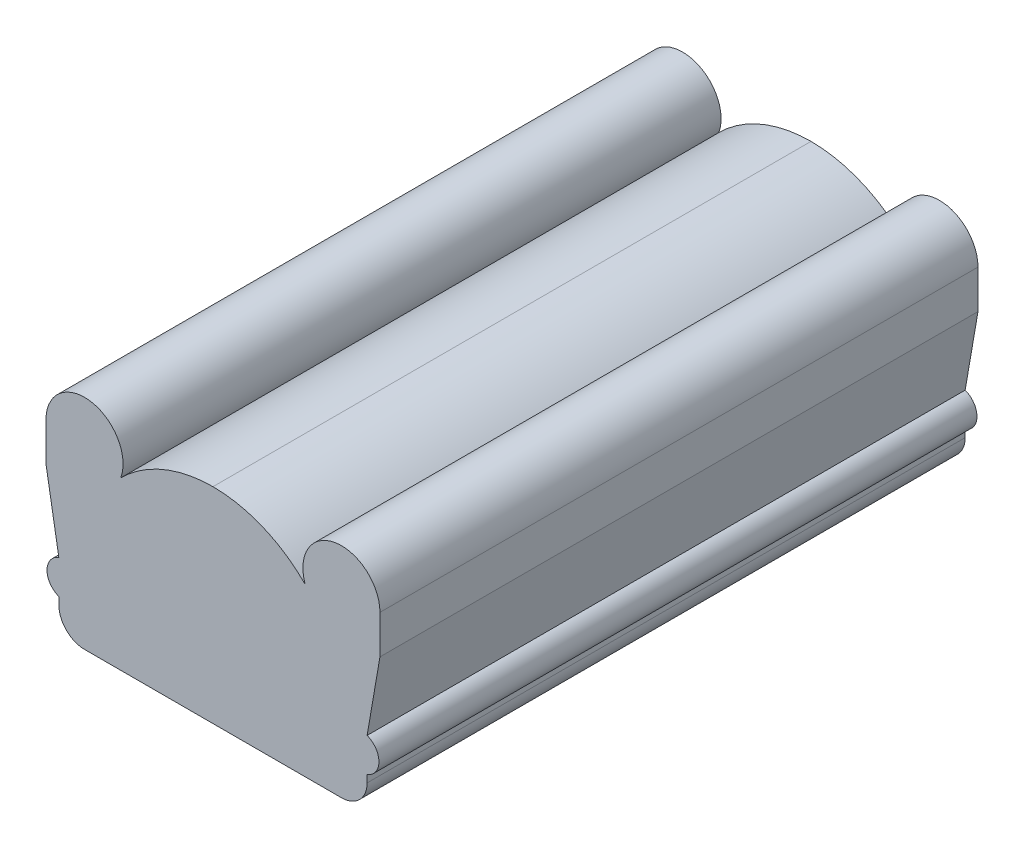
ISO-10303-21;
HEADER;
FILE_DESCRIPTION(('STEP AP214'),'2;1');
FILE_NAME('part.step','',(''),(''),'','','');
FILE_SCHEMA(('AUTOMOTIVE_DESIGN { 1 0 10303 214 1 1 1 1 }'));
ENDSEC;
DATA;
#1=APPLICATION_CONTEXT('core data for automotive mechanical design processes');
#2=APPLICATION_PROTOCOL_DEFINITION('international standard','automotive_design',2000,#1);
#3=PRODUCT_CONTEXT('',#1,'mechanical');
#4=PRODUCT('Part','Part','',(#3));
#5=PRODUCT_RELATED_PRODUCT_CATEGORY('part','',(#4));
#6=PRODUCT_DEFINITION_FORMATION('','',#4);
#7=PRODUCT_DEFINITION_CONTEXT('part definition',#1,'design');
#8=PRODUCT_DEFINITION('design','',#6,#7);
#9=PRODUCT_DEFINITION_SHAPE('','',#8);
#10=(LENGTH_UNIT() NAMED_UNIT(*) SI_UNIT(.MILLI.,.METRE.));
#11=(NAMED_UNIT(*) PLANE_ANGLE_UNIT() SI_UNIT($,.RADIAN.));
#12=(NAMED_UNIT(*) SI_UNIT($,.STERADIAN.) SOLID_ANGLE_UNIT());
#13=UNCERTAINTY_MEASURE_WITH_UNIT(LENGTH_MEASURE(1.E-05),#10,'distance_accuracy_value','');
#14=(GEOMETRIC_REPRESENTATION_CONTEXT(3) GLOBAL_UNCERTAINTY_ASSIGNED_CONTEXT((#13)) GLOBAL_UNIT_ASSIGNED_CONTEXT((#10,
#11,#12)) REPRESENTATION_CONTEXT('',''));
#15=CARTESIAN_POINT('',(0.,0.,0.));
#16=DIRECTION('',(0.,0.,1.));
#17=DIRECTION('',(1.,0.,0.));
#18=AXIS2_PLACEMENT_3D('',#15,#16,#17);
#19=CARTESIAN_POINT('',(-0.161961658351417,36.9481996765618,295.656));
#20=DIRECTION('',(0.,0.,-1.));
#21=DIRECTION('',(-1.,0.,0.));
#22=AXIS2_PLACEMENT_3D('',#19,#20,#21);
#23=CYLINDRICAL_SURFACE('',#22,64.4865199814833);
#24=CARTESIAN_POINT('',(-0.161961658351417,36.9481996765618,0.));
#25=DIRECTION('',(0.,0.,1.));
#26=DIRECTION('',(1.,0.,0.));
#27=AXIS2_PLACEMENT_3D('',#24,#25,#26);
#28=CIRCLE('',#27,64.4865199814833);
#29=CARTESIAN_POINT('',(45.5988555740285,82.3845162696459,0.));
#30=VERTEX_POINT('',#29);
#31=CARTESIAN_POINT('',(0.,101.434516269646,0.));
#32=VERTEX_POINT('',#31);
#33=EDGE_CURVE('E165',#30,#32,#28,.T.);
#34=ORIENTED_EDGE('',*,*,#33,.T.);
#35=DIRECTION('',(0.,0.,-1.));
#36=VECTOR('',#35,1.);
#37=CARTESIAN_POINT('',(0.,101.434516269646,295.656));
#38=LINE('',#37,#36);
#39=CARTESIAN_POINT('',(0.,101.434516269646,295.656));
#40=VERTEX_POINT('',#39);
#41=EDGE_CURVE('E147',#40,#32,#38,.T.);
#42=ORIENTED_EDGE('',*,*,#41,.F.);
#43=CARTESIAN_POINT('',(-0.161961658351417,36.9481996765618,295.656));
#44=DIRECTION('',(0.,0.,1.));
#45=DIRECTION('',(1.,0.,0.));
#46=AXIS2_PLACEMENT_3D('',#43,#44,#45);
#47=CIRCLE('',#46,64.4865199814833);
#48=CARTESIAN_POINT('',(45.5988555740285,82.3845162696459,295.656));
#49=VERTEX_POINT('',#48);
#50=EDGE_CURVE('E153',#49,#40,#47,.T.);
#51=ORIENTED_EDGE('',*,*,#50,.F.);
#52=DIRECTION('',(0.,0.,-1.));
#53=VECTOR('',#52,1.);
#54=CARTESIAN_POINT('',(45.5988555740285,82.3845162696459,295.656));
#55=LINE('',#54,#53);
#56=EDGE_CURVE('E221',#49,#30,#55,.T.);
#57=ORIENTED_EDGE('',*,*,#56,.T.);
#58=EDGE_LOOP('',(#34,#42,#51,#57));
#59=FACE_BOUND('',#58,.T.);
#60=ADVANCED_FACE('F33',(#59),#23,.T.);
#61=CARTESIAN_POINT('',(0.161961658351417,36.9481996765618,295.656));
#62=DIRECTION('',(0.,0.,-1.));
#63=DIRECTION('',(-1.,0.,0.));
#64=AXIS2_PLACEMENT_3D('',#61,#62,#63);
#65=CYLINDRICAL_SURFACE('',#64,64.4865199814833);
#66=CARTESIAN_POINT('',(0.161961658351417,36.9481996765618,0.));
#67=DIRECTION('',(0.,0.,1.));
#68=DIRECTION('',(-1.,0.,0.));
#69=AXIS2_PLACEMENT_3D('',#66,#67,#68);
#70=CIRCLE('',#69,64.4865199814833);
#71=CARTESIAN_POINT('',(-45.5988555740285,82.3845162696458,0.));
#72=VERTEX_POINT('',#71);
#73=EDGE_CURVE('E255',#32,#72,#70,.T.);
#74=ORIENTED_EDGE('',*,*,#73,.T.);
#75=DIRECTION('',(0.,0.,-1.));
#76=VECTOR('',#75,1.);
#77=CARTESIAN_POINT('',(-45.5988555740285,82.3845162696458,295.656));
#78=LINE('',#77,#76);
#79=CARTESIAN_POINT('',(-45.5988555740285,82.3845162696458,295.656));
#80=VERTEX_POINT('',#79);
#81=EDGE_CURVE('E150',#80,#72,#78,.T.);
#82=ORIENTED_EDGE('',*,*,#81,.F.);
#83=CARTESIAN_POINT('',(0.161961658351417,36.9481996765618,295.656));
#84=DIRECTION('',(0.,0.,1.));
#85=DIRECTION('',(-1.,0.,0.));
#86=AXIS2_PLACEMENT_3D('',#83,#84,#85);
#87=CIRCLE('',#86,64.4865199814833);
#88=EDGE_CURVE('E143',#40,#80,#87,.T.);
#89=ORIENTED_EDGE('',*,*,#88,.F.);
#90=ORIENTED_EDGE('',*,*,#41,.T.);
#91=EDGE_LOOP('',(#74,#82,#89,#90));
#92=FACE_BOUND('',#91,.T.);
#93=ADVANCED_FACE('F145',(#92),#65,.T.);
#94=CARTESIAN_POINT('',(-63.5,88.9,295.656));
#95=DIRECTION('',(0.,0.,-1.));
#96=DIRECTION('',(-1.,0.,0.));
#97=AXIS2_PLACEMENT_3D('',#94,#95,#96);
#98=CYLINDRICAL_SURFACE('',#97,19.05);
#99=CARTESIAN_POINT('',(-63.5,88.9,0.));
#100=DIRECTION('',(0.,0.,1.));
#101=DIRECTION('',(1.,0.,0.));
#102=AXIS2_PLACEMENT_3D('',#99,#100,#101);
#103=CIRCLE('',#102,19.05);
#104=CARTESIAN_POINT('',(-82.55,88.9,0.));
#105=VERTEX_POINT('',#104);
#106=EDGE_CURVE('E253',#72,#105,#103,.T.);
#107=ORIENTED_EDGE('',*,*,#106,.T.);
#108=DIRECTION('',(0.,0.,-1.));
#109=VECTOR('',#108,1.);
#110=CARTESIAN_POINT('',(-82.55,88.9,295.656));
#111=LINE('',#110,#109);
#112=CARTESIAN_POINT('',(-82.55,88.9,295.656));
#113=VERTEX_POINT('',#112);
#114=EDGE_CURVE('E170',#113,#105,#111,.T.);
#115=ORIENTED_EDGE('',*,*,#114,.F.);
#116=CARTESIAN_POINT('',(-63.5,88.9,295.656));
#117=DIRECTION('',(0.,0.,1.));
#118=DIRECTION('',(1.,0.,0.));
#119=AXIS2_PLACEMENT_3D('',#116,#117,#118);
#120=CIRCLE('',#119,19.05);
#121=EDGE_CURVE('E152',#80,#113,#120,.T.);
#122=ORIENTED_EDGE('',*,*,#121,.F.);
#123=ORIENTED_EDGE('',*,*,#81,.T.);
#124=EDGE_LOOP('',(#107,#115,#122,#123));
#125=FACE_BOUND('',#124,.T.);
#126=ADVANCED_FACE('F274',(#125),#98,.T.);
#127=CARTESIAN_POINT('',(-82.55,88.9,295.656));
#128=DIRECTION('',(1.,0.,0.));
#129=DIRECTION('',(0.,0.,-1.));
#130=AXIS2_PLACEMENT_3D('',#127,#128,#129);
#131=PLANE('',#130);
#132=DIRECTION('',(0.,-1.,0.));
#133=VECTOR('',#132,1.);
#134=CARTESIAN_POINT('',(-82.55,88.9,0.));
#135=LINE('',#134,#133);
#136=CARTESIAN_POINT('',(-82.55,69.85,0.));
#137=VERTEX_POINT('',#136);
#138=EDGE_CURVE('E248',#105,#137,#135,.T.);
#139=ORIENTED_EDGE('',*,*,#138,.T.);
#140=DIRECTION('',(0.,0.,-1.));
#141=VECTOR('',#140,1.);
#142=CARTESIAN_POINT('',(-82.55,69.85,295.656));
#143=LINE('',#142,#141);
#144=CARTESIAN_POINT('',(-82.55,69.85,295.656));
#145=VERTEX_POINT('',#144);
#146=EDGE_CURVE('E239',#145,#137,#143,.T.);
#147=ORIENTED_EDGE('',*,*,#146,.F.);
#148=DIRECTION('',(0.,-1.,0.));
#149=VECTOR('',#148,1.);
#150=CARTESIAN_POINT('',(-82.55,88.9,295.656));
#151=LINE('',#150,#149);
#152=EDGE_CURVE('E249',#113,#145,#151,.T.);
#153=ORIENTED_EDGE('',*,*,#152,.F.);
#154=ORIENTED_EDGE('',*,*,#114,.T.);
#155=EDGE_LOOP('',(#139,#147,#153,#154));
#156=FACE_BOUND('',#155,.T.);
#157=ADVANCED_FACE('F246',(#156),#131,.F.);
#158=CARTESIAN_POINT('',(-82.55,69.85,295.656));
#159=DIRECTION('',(0.985460115744348,0.169906916507646,0.));
#160=DIRECTION('',(-0.169906916507646,0.985460115744348,0.));
#161=AXIS2_PLACEMENT_3D('',#158,#159,#160);
#162=PLANE('',#161);
#163=DIRECTION('',(0.169906916507646,-0.985460115744348,0.));
#164=VECTOR('',#163,1.);
#165=CARTESIAN_POINT('',(-82.55,69.85,0.));
#166=LINE('',#165,#164);
#167=CARTESIAN_POINT('',(-76.2,33.02,0.));
#168=VERTEX_POINT('',#167);
#169=EDGE_CURVE('E209',#137,#168,#166,.T.);
#170=ORIENTED_EDGE('',*,*,#169,.T.);
#171=DIRECTION('',(0.,0.,-1.));
#172=VECTOR('',#171,1.);
#173=CARTESIAN_POINT('',(-76.2,33.02,295.656));
#174=LINE('',#173,#172);
#175=CARTESIAN_POINT('',(-76.2,33.02,295.656));
#176=VERTEX_POINT('',#175);
#177=EDGE_CURVE('E236',#176,#168,#174,.T.);
#178=ORIENTED_EDGE('',*,*,#177,.F.);
#179=DIRECTION('',(0.169906916507646,-0.985460115744348,0.));
#180=VECTOR('',#179,1.);
#181=CARTESIAN_POINT('',(-82.55,69.85,295.656));
#182=LINE('',#181,#180);
#183=EDGE_CURVE('E271',#145,#176,#182,.T.);
#184=ORIENTED_EDGE('',*,*,#183,.F.);
#185=ORIENTED_EDGE('',*,*,#146,.T.);
#186=EDGE_LOOP('',(#170,#178,#184,#185));
#187=FACE_BOUND('',#186,.T.);
#188=ADVANCED_FACE('F281',(#187),#162,.F.);
#189=CARTESIAN_POINT('',(-73.152,24.668844630831,295.656));
#190=DIRECTION('',(0.,0.,-1.));
#191=DIRECTION('',(-1.,0.,0.));
#192=AXIS2_PLACEMENT_3D('',#189,#190,#191);
#193=CYLINDRICAL_SURFACE('',#192,8.89);
#194=CARTESIAN_POINT('',(-73.152,24.668844630831,0.));
#195=DIRECTION('',(0.,0.,1.));
#196=DIRECTION('',(1.,0.,0.));
#197=AXIS2_PLACEMENT_3D('',#194,#195,#196);
#198=CIRCLE('',#197,8.89);
#199=CARTESIAN_POINT('',(-76.2,16.317689261662,0.));
#200=VERTEX_POINT('',#199);
#201=EDGE_CURVE('E205',#168,#200,#198,.T.);
#202=ORIENTED_EDGE('',*,*,#201,.T.);
#203=DIRECTION('',(0.,0.,-1.));
#204=VECTOR('',#203,1.);
#205=CARTESIAN_POINT('',(-76.2,16.317689261662,295.656));
#206=LINE('',#205,#204);
#207=CARTESIAN_POINT('',(-76.2,16.317689261662,295.656));
#208=VERTEX_POINT('',#207);
#209=EDGE_CURVE('E204',#208,#200,#206,.T.);
#210=ORIENTED_EDGE('',*,*,#209,.F.);
#211=CARTESIAN_POINT('',(-73.152,24.668844630831,295.656));
#212=DIRECTION('',(0.,0.,1.));
#213=DIRECTION('',(1.,0.,0.));
#214=AXIS2_PLACEMENT_3D('',#211,#212,#213);
#215=CIRCLE('',#214,8.89);
#216=EDGE_CURVE('E269',#176,#208,#215,.T.);
#217=ORIENTED_EDGE('',*,*,#216,.F.);
#218=ORIENTED_EDGE('',*,*,#177,.T.);
#219=EDGE_LOOP('',(#202,#210,#217,#218));
#220=FACE_BOUND('',#219,.T.);
#221=ADVANCED_FACE('F324',(#220),#193,.T.);
#222=CARTESIAN_POINT('',(-76.2,16.317689261662,295.656));
#223=DIRECTION('',(1.,0.,0.));
#224=DIRECTION('',(0.,0.,-1.));
#225=AXIS2_PLACEMENT_3D('',#222,#223,#224);
#226=PLANE('',#225);
#227=DIRECTION('',(0.,-1.,0.));
#228=VECTOR('',#227,1.);
#229=CARTESIAN_POINT('',(-76.2,16.317689261662,0.));
#230=LINE('',#229,#228);
#231=CARTESIAN_POINT('',(-76.2,12.7,0.));
#232=VERTEX_POINT('',#231);
#233=EDGE_CURVE('E199',#200,#232,#230,.T.);
#234=ORIENTED_EDGE('',*,*,#233,.T.);
#235=DIRECTION('',(0.,0.,-1.));
#236=VECTOR('',#235,1.);
#237=CARTESIAN_POINT('',(-76.2,12.7,295.656));
#238=LINE('',#237,#236);
#239=CARTESIAN_POINT('',(-76.2,12.7,295.656));
#240=VERTEX_POINT('',#239);
#241=EDGE_CURVE('E56',#232,#240,#238,.F.);
#242=ORIENTED_EDGE('',*,*,#241,.T.);
#243=DIRECTION('',(0.,-1.,0.));
#244=VECTOR('',#243,1.);
#245=CARTESIAN_POINT('',(-76.2,16.317689261662,295.656));
#246=LINE('',#245,#244);
#247=EDGE_CURVE('E184',#208,#240,#246,.T.);
#248=ORIENTED_EDGE('',*,*,#247,.F.);
#249=ORIENTED_EDGE('',*,*,#209,.T.);
#250=EDGE_LOOP('',(#234,#242,#248,#249));
#251=FACE_BOUND('',#250,.T.);
#252=ADVANCED_FACE('F202',(#251),#226,.F.);
#253=CARTESIAN_POINT('',(76.2,0.,295.656));
#254=DIRECTION('',(0.,1.,0.));
#255=DIRECTION('',(0.,0.,1.));
#256=AXIS2_PLACEMENT_3D('',#253,#254,#255);
#257=PLANE('',#256);
#258=DIRECTION('',(1.,0.,0.));
#259=VECTOR('',#258,1.);
#260=CARTESIAN_POINT('',(76.2,0.,295.656));
#261=LINE('',#260,#259);
#262=CARTESIAN_POINT('',(-63.4999999999999,0.,295.656));
#263=VERTEX_POINT('',#262);
#264=CARTESIAN_POINT('',(63.5,0.,295.656));
#265=VERTEX_POINT('',#264);
#266=EDGE_CURVE('E183',#263,#265,#261,.T.);
#267=ORIENTED_EDGE('',*,*,#266,.F.);
#268=DIRECTION('',(0.,0.,-1.));
#269=VECTOR('',#268,1.);
#270=CARTESIAN_POINT('',(-63.5,0.,295.656));
#271=LINE('',#270,#269);
#272=CARTESIAN_POINT('',(-63.4999999999999,0.,0.));
#273=VERTEX_POINT('',#272);
#274=EDGE_CURVE('E168',#263,#273,#271,.T.);
#275=ORIENTED_EDGE('',*,*,#274,.T.);
#276=DIRECTION('',(1.,0.,0.));
#277=VECTOR('',#276,1.);
#278=CARTESIAN_POINT('',(76.2,0.,0.));
#279=LINE('',#278,#277);
#280=CARTESIAN_POINT('',(63.5,0.,0.));
#281=VERTEX_POINT('',#280);
#282=EDGE_CURVE('E200',#273,#281,#279,.T.);
#283=ORIENTED_EDGE('',*,*,#282,.T.);
#284=DIRECTION('',(0.,0.,-1.));
#285=VECTOR('',#284,1.);
#286=CARTESIAN_POINT('',(63.5,0.,295.656));
#287=LINE('',#286,#285);
#288=EDGE_CURVE('E166',#281,#265,#287,.F.);
#289=ORIENTED_EDGE('',*,*,#288,.T.);
#290=EDGE_LOOP('',(#267,#275,#283,#289));
#291=FACE_BOUND('',#290,.T.);
#292=ADVANCED_FACE('F188',(#291),#257,.F.);
#293=CARTESIAN_POINT('',(76.2,16.317689261662,295.656));
#294=DIRECTION('',(-1.,0.,0.));
#295=DIRECTION('',(0.,0.,1.));
#296=AXIS2_PLACEMENT_3D('',#293,#294,#295);
#297=PLANE('',#296);
#298=DIRECTION('',(0.,1.,0.));
#299=VECTOR('',#298,1.);
#300=CARTESIAN_POINT('',(76.2,16.317689261662,295.656));
#301=LINE('',#300,#299);
#302=CARTESIAN_POINT('',(76.2,12.7,295.656));
#303=VERTEX_POINT('',#302);
#304=CARTESIAN_POINT('',(76.2,16.317689261662,295.656));
#305=VERTEX_POINT('',#304);
#306=EDGE_CURVE('E192',#303,#305,#301,.T.);
#307=ORIENTED_EDGE('',*,*,#306,.F.);
#308=DIRECTION('',(0.,0.,-1.));
#309=VECTOR('',#308,1.);
#310=CARTESIAN_POINT('',(76.2,12.7,295.656));
#311=LINE('',#310,#309);
#312=CARTESIAN_POINT('',(76.2,12.7,0.));
#313=VERTEX_POINT('',#312);
#314=EDGE_CURVE('E11',#303,#313,#311,.T.);
#315=ORIENTED_EDGE('',*,*,#314,.T.);
#316=DIRECTION('',(0.,1.,0.));
#317=VECTOR('',#316,1.);
#318=CARTESIAN_POINT('',(76.2,16.317689261662,0.));
#319=LINE('',#318,#317);
#320=CARTESIAN_POINT('',(76.2,16.317689261662,0.));
#321=VERTEX_POINT('',#320);
#322=EDGE_CURVE('E207',#313,#321,#319,.T.);
#323=ORIENTED_EDGE('',*,*,#322,.T.);
#324=DIRECTION('',(0.,0.,-1.));
#325=VECTOR('',#324,1.);
#326=CARTESIAN_POINT('',(76.2,16.317689261662,295.656));
#327=LINE('',#326,#325);
#328=EDGE_CURVE('E232',#305,#321,#327,.T.);
#329=ORIENTED_EDGE('',*,*,#328,.F.);
#330=EDGE_LOOP('',(#307,#315,#323,#329));
#331=FACE_BOUND('',#330,.T.);
#332=ADVANCED_FACE('F315',(#331),#297,.F.);
#333=CARTESIAN_POINT('',(73.152,24.668844630831,295.656));
#334=DIRECTION('',(0.,0.,-1.));
#335=DIRECTION('',(-1.,0.,0.));
#336=AXIS2_PLACEMENT_3D('',#333,#334,#335);
#337=CYLINDRICAL_SURFACE('',#336,8.89);
#338=CARTESIAN_POINT('',(73.152,24.668844630831,0.));
#339=DIRECTION('',(0.,0.,1.));
#340=DIRECTION('',(-1.,0.,0.));
#341=AXIS2_PLACEMENT_3D('',#338,#339,#340);
#342=CIRCLE('',#341,8.89);
#343=CARTESIAN_POINT('',(76.2,33.02,0.));
#344=VERTEX_POINT('',#343);
#345=EDGE_CURVE('E214',#321,#344,#342,.T.);
#346=ORIENTED_EDGE('',*,*,#345,.T.);
#347=DIRECTION('',(0.,0.,-1.));
#348=VECTOR('',#347,1.);
#349=CARTESIAN_POINT('',(76.2,33.02,295.656));
#350=LINE('',#349,#348);
#351=CARTESIAN_POINT('',(76.2,33.02,295.656));
#352=VERTEX_POINT('',#351);
#353=EDGE_CURVE('E229',#352,#344,#350,.T.);
#354=ORIENTED_EDGE('',*,*,#353,.F.);
#355=CARTESIAN_POINT('',(73.152,24.668844630831,295.656));
#356=DIRECTION('',(0.,0.,1.));
#357=DIRECTION('',(-1.,0.,0.));
#358=AXIS2_PLACEMENT_3D('',#355,#356,#357);
#359=CIRCLE('',#358,8.89);
#360=EDGE_CURVE('E265',#305,#352,#359,.T.);
#361=ORIENTED_EDGE('',*,*,#360,.F.);
#362=ORIENTED_EDGE('',*,*,#328,.T.);
#363=EDGE_LOOP('',(#346,#354,#361,#362));
#364=FACE_BOUND('',#363,.T.);
#365=ADVANCED_FACE('F311',(#364),#337,.T.);
#366=CARTESIAN_POINT('',(82.55,69.85,295.656));
#367=DIRECTION('',(-0.985460115744348,0.169906916507646,0.));
#368=DIRECTION('',(-0.169906916507646,-0.985460115744348,0.));
#369=AXIS2_PLACEMENT_3D('',#366,#367,#368);
#370=PLANE('',#369);
#371=DIRECTION('',(0.169906916507646,0.985460115744348,0.));
#372=VECTOR('',#371,1.);
#373=CARTESIAN_POINT('',(82.55,69.85,0.));
#374=LINE('',#373,#372);
#375=CARTESIAN_POINT('',(82.55,69.85,0.));
#376=VERTEX_POINT('',#375);
#377=EDGE_CURVE('E216',#344,#376,#374,.T.);
#378=ORIENTED_EDGE('',*,*,#377,.T.);
#379=DIRECTION('',(0.,0.,-1.));
#380=VECTOR('',#379,1.);
#381=CARTESIAN_POINT('',(82.55,69.85,295.656));
#382=LINE('',#381,#380);
#383=CARTESIAN_POINT('',(82.55,69.85,295.656));
#384=VERTEX_POINT('',#383);
#385=EDGE_CURVE('E226',#384,#376,#382,.T.);
#386=ORIENTED_EDGE('',*,*,#385,.F.);
#387=DIRECTION('',(0.169906916507646,0.985460115744348,0.));
#388=VECTOR('',#387,1.);
#389=CARTESIAN_POINT('',(82.55,69.85,295.656));
#390=LINE('',#389,#388);
#391=EDGE_CURVE('E263',#352,#384,#390,.T.);
#392=ORIENTED_EDGE('',*,*,#391,.F.);
#393=ORIENTED_EDGE('',*,*,#353,.T.);
#394=EDGE_LOOP('',(#378,#386,#392,#393));
#395=FACE_BOUND('',#394,.T.);
#396=ADVANCED_FACE('F307',(#395),#370,.F.);
#397=CARTESIAN_POINT('',(82.55,88.9,295.656));
#398=DIRECTION('',(-1.,0.,0.));
#399=DIRECTION('',(0.,0.,1.));
#400=AXIS2_PLACEMENT_3D('',#397,#398,#399);
#401=PLANE('',#400);
#402=DIRECTION('',(0.,1.,0.));
#403=VECTOR('',#402,1.);
#404=CARTESIAN_POINT('',(82.55,88.9,0.));
#405=LINE('',#404,#403);
#406=CARTESIAN_POINT('',(82.55,88.9,0.));
#407=VERTEX_POINT('',#406);
#408=EDGE_CURVE('E218',#376,#407,#405,.T.);
#409=ORIENTED_EDGE('',*,*,#408,.T.);
#410=DIRECTION('',(0.,0.,-1.));
#411=VECTOR('',#410,1.);
#412=CARTESIAN_POINT('',(82.55,88.9,295.656));
#413=LINE('',#412,#411);
#414=CARTESIAN_POINT('',(82.55,88.9,295.656));
#415=VERTEX_POINT('',#414);
#416=EDGE_CURVE('E223',#415,#407,#413,.T.);
#417=ORIENTED_EDGE('',*,*,#416,.F.);
#418=DIRECTION('',(0.,1.,0.));
#419=VECTOR('',#418,1.);
#420=CARTESIAN_POINT('',(82.55,88.9,295.656));
#421=LINE('',#420,#419);
#422=EDGE_CURVE('E261',#384,#415,#421,.T.);
#423=ORIENTED_EDGE('',*,*,#422,.F.);
#424=ORIENTED_EDGE('',*,*,#385,.T.);
#425=EDGE_LOOP('',(#409,#417,#423,#424));
#426=FACE_BOUND('',#425,.T.);
#427=ADVANCED_FACE('F303',(#426),#401,.F.);
#428=CARTESIAN_POINT('',(63.5,88.9,295.656));
#429=DIRECTION('',(0.,0.,-1.));
#430=DIRECTION('',(-1.,0.,0.));
#431=AXIS2_PLACEMENT_3D('',#428,#429,#430);
#432=CYLINDRICAL_SURFACE('',#431,19.05);
#433=CARTESIAN_POINT('',(63.5,88.9,0.));
#434=DIRECTION('',(0.,0.,1.));
#435=DIRECTION('',(-1.,0.,0.));
#436=AXIS2_PLACEMENT_3D('',#433,#434,#435);
#437=CIRCLE('',#436,19.05);
#438=EDGE_CURVE('E162',#407,#30,#437,.T.);
#439=ORIENTED_EDGE('',*,*,#438,.T.);
#440=ORIENTED_EDGE('',*,*,#56,.F.);
#441=CARTESIAN_POINT('',(63.5,88.9,295.656));
#442=DIRECTION('',(0.,0.,1.));
#443=DIRECTION('',(-1.,0.,0.));
#444=AXIS2_PLACEMENT_3D('',#441,#442,#443);
#445=CIRCLE('',#444,19.05);
#446=EDGE_CURVE('E158',#415,#49,#445,.T.);
#447=ORIENTED_EDGE('',*,*,#446,.F.);
#448=ORIENTED_EDGE('',*,*,#416,.T.);
#449=EDGE_LOOP('',(#439,#440,#447,#448));
#450=FACE_BOUND('',#449,.T.);
#451=ADVANCED_FACE('F298',(#450),#432,.T.);
#452=CARTESIAN_POINT('',(-0.161961658351417,36.9481996765618,295.656));
#453=DIRECTION('',(0.,0.,1.));
#454=DIRECTION('',(1.,0.,0.));
#455=AXIS2_PLACEMENT_3D('',#452,#453,#454);
#456=PLANE('',#455);
#457=ORIENTED_EDGE('',*,*,#247,.T.);
#458=CARTESIAN_POINT('',(-63.5,12.7,295.656));
#459=DIRECTION('',(0.,0.,1.));
#460=DIRECTION('',(1.,0.,0.));
#461=AXIS2_PLACEMENT_3D('',#458,#459,#460);
#462=CIRCLE('',#461,12.7);
#463=EDGE_CURVE('E41',#240,#263,#462,.T.);
#464=ORIENTED_EDGE('',*,*,#463,.T.);
#465=ORIENTED_EDGE('',*,*,#266,.T.);
#466=CARTESIAN_POINT('',(63.5,12.7,295.656));
#467=DIRECTION('',(0.,0.,1.));
#468=DIRECTION('',(1.,0.,0.));
#469=AXIS2_PLACEMENT_3D('',#466,#467,#468);
#470=CIRCLE('',#469,12.7);
#471=EDGE_CURVE('E48',#265,#303,#470,.T.);
#472=ORIENTED_EDGE('',*,*,#471,.T.);
#473=ORIENTED_EDGE('',*,*,#306,.T.);
#474=ORIENTED_EDGE('',*,*,#360,.T.);
#475=ORIENTED_EDGE('',*,*,#391,.T.);
#476=ORIENTED_EDGE('',*,*,#422,.T.);
#477=ORIENTED_EDGE('',*,*,#446,.T.);
#478=ORIENTED_EDGE('',*,*,#50,.T.);
#479=ORIENTED_EDGE('',*,*,#88,.T.);
#480=ORIENTED_EDGE('',*,*,#121,.T.);
#481=ORIENTED_EDGE('',*,*,#152,.T.);
#482=ORIENTED_EDGE('',*,*,#183,.T.);
#483=ORIENTED_EDGE('',*,*,#216,.T.);
#484=EDGE_LOOP('',(#457,#464,#465,#472,#473,#474,#475,#476,#477,#478,#479,#480,#481,#482,#483));
#485=FACE_BOUND('',#484,.T.);
#486=ADVANCED_FACE('F156',(#485),#456,.T.);
#487=CARTESIAN_POINT('',(-0.161961658351417,36.9481996765618,0.));
#488=DIRECTION('',(0.,0.,1.));
#489=DIRECTION('',(1.,0.,0.));
#490=AXIS2_PLACEMENT_3D('',#487,#488,#489);
#491=PLANE('',#490);
#492=ORIENTED_EDGE('',*,*,#282,.F.);
#493=CARTESIAN_POINT('',(-63.5,12.7,0.));
#494=DIRECTION('',(0.,0.,1.));
#495=DIRECTION('',(1.,0.,0.));
#496=AXIS2_PLACEMENT_3D('',#493,#494,#495);
#497=CIRCLE('',#496,12.7);
#498=EDGE_CURVE('E178',#273,#232,#497,.F.);
#499=ORIENTED_EDGE('',*,*,#498,.T.);
#500=ORIENTED_EDGE('',*,*,#233,.F.);
#501=ORIENTED_EDGE('',*,*,#201,.F.);
#502=ORIENTED_EDGE('',*,*,#169,.F.);
#503=ORIENTED_EDGE('',*,*,#138,.F.);
#504=ORIENTED_EDGE('',*,*,#106,.F.);
#505=ORIENTED_EDGE('',*,*,#73,.F.);
#506=ORIENTED_EDGE('',*,*,#33,.F.);
#507=ORIENTED_EDGE('',*,*,#438,.F.);
#508=ORIENTED_EDGE('',*,*,#408,.F.);
#509=ORIENTED_EDGE('',*,*,#377,.F.);
#510=ORIENTED_EDGE('',*,*,#345,.F.);
#511=ORIENTED_EDGE('',*,*,#322,.F.);
#512=CARTESIAN_POINT('',(63.5,12.7,0.));
#513=DIRECTION('',(0.,0.,1.));
#514=DIRECTION('',(1.,0.,0.));
#515=AXIS2_PLACEMENT_3D('',#512,#513,#514);
#516=CIRCLE('',#515,12.7);
#517=EDGE_CURVE('E176',#313,#281,#516,.F.);
#518=ORIENTED_EDGE('',*,*,#517,.T.);
#519=EDGE_LOOP('',(#492,#499,#500,#501,#502,#503,#504,#505,#506,#507,#508,#509,#510,#511,#518));
#520=FACE_BOUND('',#519,.T.);
#521=ADVANCED_FACE('F197',(#520),#491,.F.);
#522=CARTESIAN_POINT('',(-63.5,12.7,295.656));
#523=DIRECTION('',(0.,0.,-1.));
#524=DIRECTION('',(-1.,0.,0.));
#525=AXIS2_PLACEMENT_3D('',#522,#523,#524);
#526=CYLINDRICAL_SURFACE('',#525,12.7);
#527=ORIENTED_EDGE('',*,*,#463,.F.);
#528=ORIENTED_EDGE('',*,*,#241,.F.);
#529=ORIENTED_EDGE('',*,*,#498,.F.);
#530=ORIENTED_EDGE('',*,*,#274,.F.);
#531=EDGE_LOOP('',(#527,#528,#529,#530));
#532=FACE_BOUND('',#531,.T.);
#533=ADVANCED_FACE('F194',(#532),#526,.T.);
#534=CARTESIAN_POINT('',(63.5,12.7,295.656));
#535=DIRECTION('',(0.,0.,-1.));
#536=DIRECTION('',(-1.,0.,0.));
#537=AXIS2_PLACEMENT_3D('',#534,#535,#536);
#538=CYLINDRICAL_SURFACE('',#537,12.7);
#539=ORIENTED_EDGE('',*,*,#471,.F.);
#540=ORIENTED_EDGE('',*,*,#288,.F.);
#541=ORIENTED_EDGE('',*,*,#517,.F.);
#542=ORIENTED_EDGE('',*,*,#314,.F.);
#543=EDGE_LOOP('',(#539,#540,#541,#542));
#544=FACE_BOUND('',#543,.T.);
#545=ADVANCED_FACE('F35',(#544),#538,.T.);
#546=CLOSED_SHELL('',(#60,#93,#126,#157,#188,#221,#252,#292,#332,#365,#396,#427,#451,#486,#521,
#533,#545));
#547=MANIFOLD_SOLID_BREP('B2',#546);
#548=ADVANCED_BREP_SHAPE_REPRESENTATION('',(#18,#547),#14);
#549=SHAPE_DEFINITION_REPRESENTATION(#9,#548);
ENDSEC;
END-ISO-10303-21;
